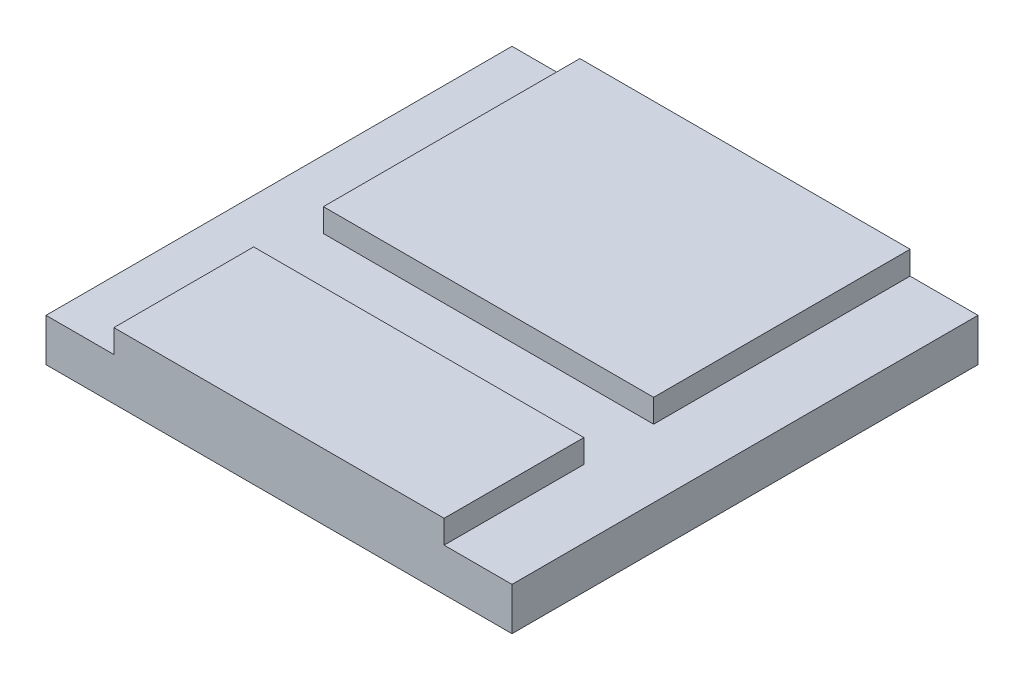
ISO-10303-21;
HEADER;
FILE_DESCRIPTION(('STEP AP214'),'2;1');
FILE_NAME('part.step','',(''),(''),'','','');
FILE_SCHEMA(('AUTOMOTIVE_DESIGN { 1 0 10303 214 1 1 1 1 }'));
ENDSEC;
DATA;
#1=APPLICATION_CONTEXT('core data for automotive mechanical design processes');
#2=APPLICATION_PROTOCOL_DEFINITION('international standard','automotive_design',2000,#1);
#3=PRODUCT_CONTEXT('',#1,'mechanical');
#4=PRODUCT('Part','Part','',(#3));
#5=PRODUCT_RELATED_PRODUCT_CATEGORY('part','',(#4));
#6=PRODUCT_DEFINITION_FORMATION('','',#4);
#7=PRODUCT_DEFINITION_CONTEXT('part definition',#1,'design');
#8=PRODUCT_DEFINITION('design','',#6,#7);
#9=PRODUCT_DEFINITION_SHAPE('','',#8);
#10=(LENGTH_UNIT() NAMED_UNIT(*) SI_UNIT(.MILLI.,.METRE.));
#11=(NAMED_UNIT(*) PLANE_ANGLE_UNIT() SI_UNIT($,.RADIAN.));
#12=(NAMED_UNIT(*) SI_UNIT($,.STERADIAN.) SOLID_ANGLE_UNIT());
#13=UNCERTAINTY_MEASURE_WITH_UNIT(LENGTH_MEASURE(1.E-05),#10,'distance_accuracy_value','');
#14=(GEOMETRIC_REPRESENTATION_CONTEXT(3) GLOBAL_UNCERTAINTY_ASSIGNED_CONTEXT((#13)) GLOBAL_UNIT_ASSIGNED_CONTEXT((#10,
#11,#12)) REPRESENTATION_CONTEXT('',''));
#15=CARTESIAN_POINT('',(0.,0.,0.));
#16=DIRECTION('',(0.,0.,1.));
#17=DIRECTION('',(1.,0.,0.));
#18=AXIS2_PLACEMENT_3D('',#15,#16,#17);
#19=CARTESIAN_POINT('',(-63.5,18.,-63.5));
#20=DIRECTION('',(1.,0.,0.));
#21=DIRECTION('',(0.,0.,-1.));
#22=AXIS2_PLACEMENT_3D('',#19,#20,#21);
#23=PLANE('',#22);
#24=DIRECTION('',(0.,0.,1.));
#25=VECTOR('',#24,1.);
#26=CARTESIAN_POINT('',(-63.5,11.65,25.4));
#27=LINE('',#26,#25);
#28=CARTESIAN_POINT('',(-63.5,11.65,-63.5));
#29=VERTEX_POINT('',#28);
#30=CARTESIAN_POINT('',(-63.5,11.65,63.5));
#31=VERTEX_POINT('',#30);
#32=EDGE_CURVE('E118',#29,#31,#27,.T.);
#33=ORIENTED_EDGE('',*,*,#32,.F.);
#34=DIRECTION('',(0.,-1.,0.));
#35=VECTOR('',#34,1.);
#36=CARTESIAN_POINT('',(-63.5,18.,-63.5));
#37=LINE('',#36,#35);
#38=CARTESIAN_POINT('',(-63.5,0.,-63.5));
#39=VERTEX_POINT('',#38);
#40=EDGE_CURVE('E143',#29,#39,#37,.T.);
#41=ORIENTED_EDGE('',*,*,#40,.T.);
#42=DIRECTION('',(0.,0.,1.));
#43=VECTOR('',#42,1.);
#44=CARTESIAN_POINT('',(-63.5,0.,-63.5));
#45=LINE('',#44,#43);
#46=CARTESIAN_POINT('',(-63.5,0.,63.5));
#47=VERTEX_POINT('',#46);
#48=EDGE_CURVE('E142',#39,#47,#45,.T.);
#49=ORIENTED_EDGE('',*,*,#48,.T.);
#50=DIRECTION('',(0.,-1.,0.));
#51=VECTOR('',#50,1.);
#52=CARTESIAN_POINT('',(-63.5,18.,63.5));
#53=LINE('',#52,#51);
#54=EDGE_CURVE('E11',#31,#47,#53,.T.);
#55=ORIENTED_EDGE('',*,*,#54,.F.);
#56=EDGE_LOOP('',(#33,#41,#49,#55));
#57=FACE_BOUND('',#56,.T.);
#58=ADVANCED_FACE('F33',(#57),#23,.F.);
#59=CARTESIAN_POINT('',(63.5,18.,-63.5));
#60=DIRECTION('',(-1.,0.,0.));
#61=DIRECTION('',(0.,0.,1.));
#62=AXIS2_PLACEMENT_3D('',#59,#60,#61);
#63=PLANE('',#62);
#64=DIRECTION('',(0.,0.,-1.));
#65=VECTOR('',#64,1.);
#66=CARTESIAN_POINT('',(63.5,11.65,25.4));
#67=LINE('',#66,#65);
#68=CARTESIAN_POINT('',(63.5,11.65,63.5));
#69=VERTEX_POINT('',#68);
#70=CARTESIAN_POINT('',(63.5,11.65,-63.5));
#71=VERTEX_POINT('',#70);
#72=EDGE_CURVE('E152',#69,#71,#67,.T.);
#73=ORIENTED_EDGE('',*,*,#72,.F.);
#74=DIRECTION('',(0.,-1.,0.));
#75=VECTOR('',#74,1.);
#76=CARTESIAN_POINT('',(63.5,18.,63.5));
#77=LINE('',#76,#75);
#78=CARTESIAN_POINT('',(63.5,0.,63.5));
#79=VERTEX_POINT('',#78);
#80=EDGE_CURVE('E40',#69,#79,#77,.T.);
#81=ORIENTED_EDGE('',*,*,#80,.T.);
#82=DIRECTION('',(0.,0.,-1.));
#83=VECTOR('',#82,1.);
#84=CARTESIAN_POINT('',(63.5,0.,-63.5));
#85=LINE('',#84,#83);
#86=CARTESIAN_POINT('',(63.5,0.,-63.5));
#87=VERTEX_POINT('',#86);
#88=EDGE_CURVE('E150',#79,#87,#85,.T.);
#89=ORIENTED_EDGE('',*,*,#88,.T.);
#90=DIRECTION('',(0.,-1.,0.));
#91=VECTOR('',#90,1.);
#92=CARTESIAN_POINT('',(63.5,18.,-63.5));
#93=LINE('',#92,#91);
#94=EDGE_CURVE('E164',#71,#87,#93,.T.);
#95=ORIENTED_EDGE('',*,*,#94,.F.);
#96=EDGE_LOOP('',(#73,#81,#89,#95));
#97=FACE_BOUND('',#96,.T.);
#98=ADVANCED_FACE('F167',(#97),#63,.F.);
#99=CARTESIAN_POINT('',(0.,18.,0.));
#100=DIRECTION('',(0.,-1.,0.));
#101=DIRECTION('',(0.,0.,-1.));
#102=AXIS2_PLACEMENT_3D('',#99,#100,#101);
#103=PLANE('',#102);
#104=DIRECTION('',(-1.,0.,0.));
#105=VECTOR('',#104,1.);
#106=CARTESIAN_POINT('',(63.5,18.,-63.5));
#107=LINE('',#106,#105);
#108=CARTESIAN_POINT('',(45.,18.,-63.5));
#109=VERTEX_POINT('',#108);
#110=CARTESIAN_POINT('',(-45.,18.,-63.5));
#111=VERTEX_POINT('',#110);
#112=EDGE_CURVE('E155',#109,#111,#107,.T.);
#113=ORIENTED_EDGE('',*,*,#112,.T.);
#114=DIRECTION('',(0.,0.,-1.));
#115=VECTOR('',#114,1.);
#116=CARTESIAN_POINT('',(-45.,18.,-63.5));
#117=LINE('',#116,#115);
#118=CARTESIAN_POINT('',(-45.,18.,6.4));
#119=VERTEX_POINT('',#118);
#120=EDGE_CURVE('E217',#119,#111,#117,.T.);
#121=ORIENTED_EDGE('',*,*,#120,.F.);
#122=DIRECTION('',(-1.,0.,0.));
#123=VECTOR('',#122,1.);
#124=CARTESIAN_POINT('',(-63.5,18.,6.4));
#125=LINE('',#124,#123);
#126=CARTESIAN_POINT('',(45.,18.,6.4));
#127=VERTEX_POINT('',#126);
#128=EDGE_CURVE('E129',#127,#119,#125,.T.);
#129=ORIENTED_EDGE('',*,*,#128,.F.);
#130=DIRECTION('',(0.,0.,1.));
#131=VECTOR('',#130,1.);
#132=CARTESIAN_POINT('',(45.,18.,63.5));
#133=LINE('',#132,#131);
#134=EDGE_CURVE('E181',#109,#127,#133,.T.);
#135=ORIENTED_EDGE('',*,*,#134,.F.);
#136=EDGE_LOOP('',(#113,#121,#129,#135));
#137=FACE_BOUND('',#136,.T.);
#138=ADVANCED_FACE('F215',(#137),#103,.F.);
#139=CARTESIAN_POINT('',(63.5,18.,63.5));
#140=DIRECTION('',(0.,0.,-1.));
#141=DIRECTION('',(-1.,0.,0.));
#142=AXIS2_PLACEMENT_3D('',#139,#140,#141);
#143=PLANE('',#142);
#144=DIRECTION('',(1.,0.,0.));
#145=VECTOR('',#144,1.);
#146=CARTESIAN_POINT('',(63.5,18.,63.5));
#147=LINE('',#146,#145);
#148=CARTESIAN_POINT('',(-45.,18.,63.5));
#149=VERTEX_POINT('',#148);
#150=CARTESIAN_POINT('',(45.,18.,63.5));
#151=VERTEX_POINT('',#150);
#152=EDGE_CURVE('E162',#149,#151,#147,.T.);
#153=ORIENTED_EDGE('',*,*,#152,.F.);
#154=DIRECTION('',(0.,1.,0.));
#155=VECTOR('',#154,1.);
#156=CARTESIAN_POINT('',(-45.,11.65,63.5));
#157=LINE('',#156,#155);
#158=CARTESIAN_POINT('',(-45.,11.65,63.5));
#159=VERTEX_POINT('',#158);
#160=EDGE_CURVE('E136',#159,#149,#157,.T.);
#161=ORIENTED_EDGE('',*,*,#160,.F.);
#162=DIRECTION('',(1.,0.,0.));
#163=VECTOR('',#162,1.);
#164=CARTESIAN_POINT('',(-63.5,11.65,63.5));
#165=LINE('',#164,#163);
#166=EDGE_CURVE('E121',#31,#159,#165,.T.);
#167=ORIENTED_EDGE('',*,*,#166,.F.);
#168=ORIENTED_EDGE('',*,*,#54,.T.);
#169=DIRECTION('',(1.,0.,0.));
#170=VECTOR('',#169,1.);
#171=CARTESIAN_POINT('',(63.5,0.,63.5));
#172=LINE('',#171,#170);
#173=EDGE_CURVE('E147',#47,#79,#172,.T.);
#174=ORIENTED_EDGE('',*,*,#173,.T.);
#175=ORIENTED_EDGE('',*,*,#80,.F.);
#176=DIRECTION('',(1.,0.,0.));
#177=VECTOR('',#176,1.);
#178=CARTESIAN_POINT('',(63.5,11.65,63.5));
#179=LINE('',#178,#177);
#180=CARTESIAN_POINT('',(45.,11.65,63.5));
#181=VERTEX_POINT('',#180);
#182=EDGE_CURVE('E190',#181,#69,#179,.T.);
#183=ORIENTED_EDGE('',*,*,#182,.F.);
#184=DIRECTION('',(0.,1.,0.));
#185=VECTOR('',#184,1.);
#186=CARTESIAN_POINT('',(45.,11.65,63.5));
#187=LINE('',#186,#185);
#188=EDGE_CURVE('E192',#181,#151,#187,.T.);
#189=ORIENTED_EDGE('',*,*,#188,.T.);
#190=EDGE_LOOP('',(#153,#161,#167,#168,#174,#175,#183,#189));
#191=FACE_BOUND('',#190,.T.);
#192=ADVANCED_FACE('F133',(#191),#143,.F.);
#193=CARTESIAN_POINT('',(63.5,18.,-63.5));
#194=DIRECTION('',(0.,0.,1.));
#195=DIRECTION('',(1.,0.,0.));
#196=AXIS2_PLACEMENT_3D('',#193,#194,#195);
#197=PLANE('',#196);
#198=DIRECTION('',(-1.,0.,0.));
#199=VECTOR('',#198,1.);
#200=CARTESIAN_POINT('',(-63.5,11.65,-63.5));
#201=LINE('',#200,#199);
#202=CARTESIAN_POINT('',(-45.,11.65,-63.5));
#203=VERTEX_POINT('',#202);
#204=EDGE_CURVE('E124',#203,#29,#201,.T.);
#205=ORIENTED_EDGE('',*,*,#204,.F.);
#206=DIRECTION('',(0.,1.,0.));
#207=VECTOR('',#206,1.);
#208=CARTESIAN_POINT('',(-45.,11.65,-63.5));
#209=LINE('',#208,#207);
#210=EDGE_CURVE('E220',#203,#111,#209,.T.);
#211=ORIENTED_EDGE('',*,*,#210,.T.);
#212=ORIENTED_EDGE('',*,*,#112,.F.);
#213=DIRECTION('',(0.,1.,0.));
#214=VECTOR('',#213,1.);
#215=CARTESIAN_POINT('',(45.,11.65,-63.5));
#216=LINE('',#215,#214);
#217=CARTESIAN_POINT('',(45.,11.65,-63.5));
#218=VERTEX_POINT('',#217);
#219=EDGE_CURVE('E179',#218,#109,#216,.T.);
#220=ORIENTED_EDGE('',*,*,#219,.F.);
#221=DIRECTION('',(-1.,0.,0.));
#222=VECTOR('',#221,1.);
#223=CARTESIAN_POINT('',(63.5,11.65,-63.5));
#224=LINE('',#223,#222);
#225=EDGE_CURVE('E177',#71,#218,#224,.T.);
#226=ORIENTED_EDGE('',*,*,#225,.F.);
#227=ORIENTED_EDGE('',*,*,#94,.T.);
#228=DIRECTION('',(-1.,0.,0.));
#229=VECTOR('',#228,1.);
#230=CARTESIAN_POINT('',(63.5,0.,-63.5));
#231=LINE('',#230,#229);
#232=EDGE_CURVE('E160',#87,#39,#231,.T.);
#233=ORIENTED_EDGE('',*,*,#232,.T.);
#234=ORIENTED_EDGE('',*,*,#40,.F.);
#235=EDGE_LOOP('',(#205,#211,#212,#220,#226,#227,#233,#234));
#236=FACE_BOUND('',#235,.T.);
#237=ADVANCED_FACE('F174',(#236),#197,.F.);
#238=DIRECTION('',(1.,0.,0.));
#239=VECTOR('',#238,1.);
#240=CARTESIAN_POINT('',(-63.5,18.,25.4));
#241=LINE('',#240,#239);
#242=CARTESIAN_POINT('',(-45.,18.,25.4));
#243=VERTEX_POINT('',#242);
#244=CARTESIAN_POINT('',(45.,18.,25.4));
#245=VERTEX_POINT('',#244);
#246=EDGE_CURVE('E201',#243,#245,#241,.T.);
#247=ORIENTED_EDGE('',*,*,#246,.F.);
#248=EDGE_CURVE('E138',#149,#243,#117,.T.);
#249=ORIENTED_EDGE('',*,*,#248,.F.);
#250=ORIENTED_EDGE('',*,*,#152,.T.);
#251=EDGE_CURVE('E184',#245,#151,#133,.T.);
#252=ORIENTED_EDGE('',*,*,#251,.F.);
#253=EDGE_LOOP('',(#247,#249,#250,#252));
#254=FACE_BOUND('',#253,.T.);
#255=ADVANCED_FACE('F243',(#254),#103,.F.);
#256=CARTESIAN_POINT('',(0.,0.,0.));
#257=DIRECTION('',(0.,-1.,0.));
#258=DIRECTION('',(0.,0.,-1.));
#259=AXIS2_PLACEMENT_3D('',#256,#257,#258);
#260=PLANE('',#259);
#261=ORIENTED_EDGE('',*,*,#48,.F.);
#262=ORIENTED_EDGE('',*,*,#232,.F.);
#263=ORIENTED_EDGE('',*,*,#88,.F.);
#264=ORIENTED_EDGE('',*,*,#173,.F.);
#265=EDGE_LOOP('',(#261,#262,#263,#264));
#266=FACE_BOUND('',#265,.T.);
#267=ADVANCED_FACE('F172',(#266),#260,.T.);
#268=CARTESIAN_POINT('',(-63.5,11.65,6.4));
#269=DIRECTION('',(0.,0.,-1.));
#270=DIRECTION('',(-1.,0.,0.));
#271=AXIS2_PLACEMENT_3D('',#268,#269,#270);
#272=PLANE('',#271);
#273=ORIENTED_EDGE('',*,*,#128,.T.);
#274=DIRECTION('',(0.,-1.,0.));
#275=VECTOR('',#274,1.);
#276=CARTESIAN_POINT('',(-45.,11.65,6.4));
#277=LINE('',#276,#275);
#278=CARTESIAN_POINT('',(-45.,11.65,6.4));
#279=VERTEX_POINT('',#278);
#280=EDGE_CURVE('E187',#119,#279,#277,.T.);
#281=ORIENTED_EDGE('',*,*,#280,.T.);
#282=DIRECTION('',(-1.,0.,0.));
#283=VECTOR('',#282,1.);
#284=CARTESIAN_POINT('',(-63.5,11.65,6.4));
#285=LINE('',#284,#283);
#286=CARTESIAN_POINT('',(45.,11.65,6.4));
#287=VERTEX_POINT('',#286);
#288=EDGE_CURVE('E148',#287,#279,#285,.T.);
#289=ORIENTED_EDGE('',*,*,#288,.F.);
#290=DIRECTION('',(0.,1.,0.));
#291=VECTOR('',#290,1.);
#292=CARTESIAN_POINT('',(45.,11.65,6.4));
#293=LINE('',#292,#291);
#294=EDGE_CURVE('E199',#287,#127,#293,.T.);
#295=ORIENTED_EDGE('',*,*,#294,.T.);
#296=EDGE_LOOP('',(#273,#281,#289,#295));
#297=FACE_BOUND('',#296,.T.);
#298=ADVANCED_FACE('F233',(#297),#272,.F.);
#299=CARTESIAN_POINT('',(-63.5,11.65,25.4));
#300=DIRECTION('',(0.,0.,1.));
#301=DIRECTION('',(1.,0.,0.));
#302=AXIS2_PLACEMENT_3D('',#299,#300,#301);
#303=PLANE('',#302);
#304=DIRECTION('',(1.,0.,0.));
#305=VECTOR('',#304,1.);
#306=CARTESIAN_POINT('',(-63.5,11.65,25.4));
#307=LINE('',#306,#305);
#308=CARTESIAN_POINT('',(-45.,11.65,25.4));
#309=VERTEX_POINT('',#308);
#310=CARTESIAN_POINT('',(45.,11.65,25.4));
#311=VERTEX_POINT('',#310);
#312=EDGE_CURVE('E128',#309,#311,#307,.T.);
#313=ORIENTED_EDGE('',*,*,#312,.F.);
#314=DIRECTION('',(0.,1.,0.));
#315=VECTOR('',#314,1.);
#316=CARTESIAN_POINT('',(-45.,11.65,25.4));
#317=LINE('',#316,#315);
#318=EDGE_CURVE('E222',#309,#243,#317,.T.);
#319=ORIENTED_EDGE('',*,*,#318,.T.);
#320=ORIENTED_EDGE('',*,*,#246,.T.);
#321=DIRECTION('',(0.,-1.,0.));
#322=VECTOR('',#321,1.);
#323=CARTESIAN_POINT('',(45.,11.65,25.4));
#324=LINE('',#323,#322);
#325=EDGE_CURVE('E195',#245,#311,#324,.T.);
#326=ORIENTED_EDGE('',*,*,#325,.T.);
#327=EDGE_LOOP('',(#313,#319,#320,#326));
#328=FACE_BOUND('',#327,.T.);
#329=ADVANCED_FACE('F242',(#328),#303,.F.);
#330=CARTESIAN_POINT('',(0.,11.65,0.));
#331=DIRECTION('',(0.,-1.,0.));
#332=DIRECTION('',(0.,0.,-1.));
#333=AXIS2_PLACEMENT_3D('',#330,#331,#332);
#334=PLANE('',#333);
#335=ORIENTED_EDGE('',*,*,#288,.T.);
#336=DIRECTION('',(0.,0.,-1.));
#337=VECTOR('',#336,1.);
#338=CARTESIAN_POINT('',(-45.,11.65,-63.5));
#339=LINE('',#338,#337);
#340=EDGE_CURVE('E137',#279,#203,#339,.T.);
#341=ORIENTED_EDGE('',*,*,#340,.T.);
#342=ORIENTED_EDGE('',*,*,#204,.T.);
#343=ORIENTED_EDGE('',*,*,#32,.T.);
#344=ORIENTED_EDGE('',*,*,#166,.T.);
#345=EDGE_CURVE('E47',#159,#309,#339,.T.);
#346=ORIENTED_EDGE('',*,*,#345,.T.);
#347=ORIENTED_EDGE('',*,*,#312,.T.);
#348=DIRECTION('',(0.,0.,1.));
#349=VECTOR('',#348,1.);
#350=CARTESIAN_POINT('',(45.,11.65,63.5));
#351=LINE('',#350,#349);
#352=EDGE_CURVE('E180',#311,#181,#351,.T.);
#353=ORIENTED_EDGE('',*,*,#352,.T.);
#354=ORIENTED_EDGE('',*,*,#182,.T.);
#355=ORIENTED_EDGE('',*,*,#72,.T.);
#356=ORIENTED_EDGE('',*,*,#225,.T.);
#357=EDGE_CURVE('E54',#218,#287,#351,.T.);
#358=ORIENTED_EDGE('',*,*,#357,.T.);
#359=EDGE_LOOP('',(#335,#341,#342,#343,#344,#346,#347,#353,#354,#355,#356,#358));
#360=FACE_BOUND('',#359,.T.);
#361=ADVANCED_FACE('F120',(#360),#334,.F.);
#362=CARTESIAN_POINT('',(45.,11.65,63.5));
#363=DIRECTION('',(-1.,0.,0.));
#364=DIRECTION('',(0.,0.,1.));
#365=AXIS2_PLACEMENT_3D('',#362,#363,#364);
#366=PLANE('',#365);
#367=ORIENTED_EDGE('',*,*,#251,.T.);
#368=ORIENTED_EDGE('',*,*,#188,.F.);
#369=ORIENTED_EDGE('',*,*,#352,.F.);
#370=ORIENTED_EDGE('',*,*,#325,.F.);
#371=EDGE_LOOP('',(#367,#368,#369,#370));
#372=FACE_BOUND('',#371,.T.);
#373=ADVANCED_FACE('F237',(#372),#366,.F.);
#374=ORIENTED_EDGE('',*,*,#357,.F.);
#375=ORIENTED_EDGE('',*,*,#219,.T.);
#376=ORIENTED_EDGE('',*,*,#134,.T.);
#377=ORIENTED_EDGE('',*,*,#294,.F.);
#378=EDGE_LOOP('',(#374,#375,#376,#377));
#379=FACE_BOUND('',#378,.T.);
#380=ADVANCED_FACE('F247',(#379),#366,.F.);
#381=CARTESIAN_POINT('',(-45.,11.65,-63.5));
#382=DIRECTION('',(1.,0.,0.));
#383=DIRECTION('',(0.,0.,-1.));
#384=AXIS2_PLACEMENT_3D('',#381,#382,#383);
#385=PLANE('',#384);
#386=ORIENTED_EDGE('',*,*,#345,.F.);
#387=ORIENTED_EDGE('',*,*,#160,.T.);
#388=ORIENTED_EDGE('',*,*,#248,.T.);
#389=ORIENTED_EDGE('',*,*,#318,.F.);
#390=EDGE_LOOP('',(#386,#387,#388,#389));
#391=FACE_BOUND('',#390,.T.);
#392=ADVANCED_FACE('F245',(#391),#385,.F.);
#393=ORIENTED_EDGE('',*,*,#120,.T.);
#394=ORIENTED_EDGE('',*,*,#210,.F.);
#395=ORIENTED_EDGE('',*,*,#340,.F.);
#396=ORIENTED_EDGE('',*,*,#280,.F.);
#397=EDGE_LOOP('',(#393,#394,#395,#396));
#398=FACE_BOUND('',#397,.T.);
#399=ADVANCED_FACE('F231',(#398),#385,.F.);
#400=CLOSED_SHELL('',(#58,#98,#138,#192,#237,#255,#267,#298,#329,#361,#373,#380,#392,#399));
#401=MANIFOLD_SOLID_BREP('B2',#400);
#402=ADVANCED_BREP_SHAPE_REPRESENTATION('',(#18,#401),#14);
#403=SHAPE_DEFINITION_REPRESENTATION(#9,#402);
ENDSEC;
END-ISO-10303-21;
